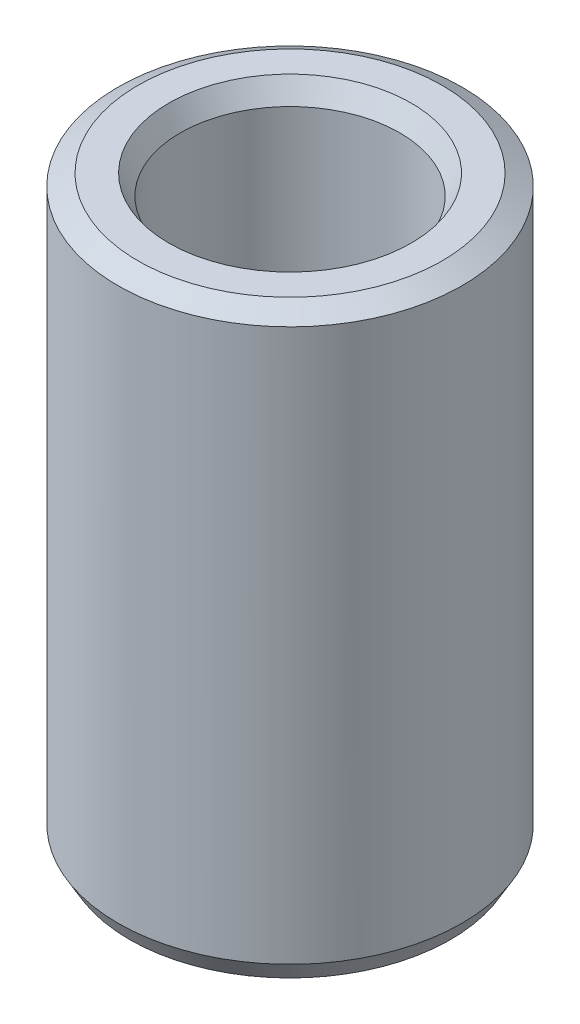
ISO-10303-21;
HEADER;
FILE_DESCRIPTION(('STEP AP214'),'2;1');
FILE_NAME('part.step','',(''),(''),'','','');
FILE_SCHEMA(('AUTOMOTIVE_DESIGN { 1 0 10303 214 1 1 1 1 }'));
ENDSEC;
DATA;
#1=APPLICATION_CONTEXT('core data for automotive mechanical design processes');
#2=APPLICATION_PROTOCOL_DEFINITION('international standard','automotive_design',2000,#1);
#3=PRODUCT_CONTEXT('',#1,'mechanical');
#4=PRODUCT('Part','Part','',(#3));
#5=PRODUCT_RELATED_PRODUCT_CATEGORY('part','',(#4));
#6=PRODUCT_DEFINITION_FORMATION('','',#4);
#7=PRODUCT_DEFINITION_CONTEXT('part definition',#1,'design');
#8=PRODUCT_DEFINITION('design','',#6,#7);
#9=PRODUCT_DEFINITION_SHAPE('','',#8);
#10=(LENGTH_UNIT() NAMED_UNIT(*) SI_UNIT(.MILLI.,.METRE.));
#11=(NAMED_UNIT(*) PLANE_ANGLE_UNIT() SI_UNIT($,.RADIAN.));
#12=(NAMED_UNIT(*) SI_UNIT($,.STERADIAN.) SOLID_ANGLE_UNIT());
#13=UNCERTAINTY_MEASURE_WITH_UNIT(LENGTH_MEASURE(1.E-05),#10,'distance_accuracy_value','');
#14=(GEOMETRIC_REPRESENTATION_CONTEXT(3) GLOBAL_UNCERTAINTY_ASSIGNED_CONTEXT((#13)) GLOBAL_UNIT_ASSIGNED_CONTEXT((#10,
#11,#12)) REPRESENTATION_CONTEXT('',''));
#15=CARTESIAN_POINT('',(0.,0.,0.));
#16=DIRECTION('',(0.,0.,1.));
#17=DIRECTION('',(1.,0.,0.));
#18=AXIS2_PLACEMENT_3D('',#15,#16,#17);
#19=CARTESIAN_POINT('',(0.,84.8043826320873,0.));
#20=DIRECTION('',(0.,-1.,0.));
#21=DIRECTION('',(0.,0.,-1.));
#22=AXIS2_PLACEMENT_3D('',#19,#20,#21);
#23=CYLINDRICAL_SURFACE('',#22,25.);
#24=CARTESIAN_POINT('',(0.,2.90175793023514,0.));
#25=DIRECTION('',(0.,1.,0.));
#26=DIRECTION('',(0.,0.,1.));
#27=AXIS2_PLACEMENT_3D('',#24,#25,#26);
#28=CIRCLE('',#27,25.);
#29=CARTESIAN_POINT('',(0.,2.90175793023514,25.));
#30=VERTEX_POINT('',#29);
#31=EDGE_CURVE('E10',#30,#30,#28,.T.);
#32=ORIENTED_EDGE('',*,*,#31,.T.);
#33=EDGE_LOOP('',(#32));
#34=FACE_BOUND('',#33,.T.);
#35=CARTESIAN_POINT('',(0.,83.1290519099429,0.));
#36=DIRECTION('',(0.,1.,0.));
#37=DIRECTION('',(0.,0.,1.));
#38=AXIS2_PLACEMENT_3D('',#35,#36,#37);
#39=CIRCLE('',#38,25.);
#40=CARTESIAN_POINT('',(0.,83.1290519099429,-25.));
#41=VERTEX_POINT('',#40);
#42=EDGE_CURVE('E50',#41,#41,#39,.F.);
#43=ORIENTED_EDGE('',*,*,#42,.T.);
#44=EDGE_LOOP('',(#43));
#45=FACE_BOUND('',#44,.T.);
#46=ADVANCED_FACE('F39',(#34,#45),#23,.T.);
#47=CARTESIAN_POINT('',(0.,84.8043826320873,0.));
#48=DIRECTION('',(0.,1.,0.));
#49=DIRECTION('',(0.,0.,1.));
#50=AXIS2_PLACEMENT_3D('',#47,#48,#49);
#51=PLANE('',#50);
#52=CARTESIAN_POINT('',(0.,84.8043826320873,0.));
#53=DIRECTION('',(0.,1.,0.));
#54=DIRECTION('',(0.,0.,1.));
#55=AXIS2_PLACEMENT_3D('',#52,#53,#54);
#56=CIRCLE('',#55,17.6229533207072);
#57=CARTESIAN_POINT('',(0.,84.8043826320873,17.6229533207072));
#58=VERTEX_POINT('',#57);
#59=EDGE_CURVE('E58',#58,#58,#56,.F.);
#60=ORIENTED_EDGE('',*,*,#59,.T.);
#61=EDGE_LOOP('',(#60));
#62=FACE_BOUND('',#61,.T.);
#63=CARTESIAN_POINT('',(0.,84.8043826320873,0.));
#64=DIRECTION('',(0.,1.,0.));
#65=DIRECTION('',(0.,0.,1.));
#66=AXIS2_PLACEMENT_3D('',#63,#64,#65);
#67=CIRCLE('',#66,22.0982420697649);
#68=CARTESIAN_POINT('',(0.,84.8043826320873,-22.0982420697649));
#69=VERTEX_POINT('',#68);
#70=EDGE_CURVE('E61',#69,#69,#67,.T.);
#71=ORIENTED_EDGE('',*,*,#70,.T.);
#72=EDGE_LOOP('',(#71));
#73=FACE_BOUND('',#72,.T.);
#74=ADVANCED_FACE('F88',(#62,#73),#51,.T.);
#75=CARTESIAN_POINT('',(0.,0.,0.));
#76=DIRECTION('',(0.,1.,0.));
#77=DIRECTION('',(0.,0.,1.));
#78=AXIS2_PLACEMENT_3D('',#75,#76,#77);
#79=PLANE('',#78);
#80=CARTESIAN_POINT('',(0.,0.,0.));
#81=DIRECTION('',(0.,1.,0.));
#82=DIRECTION('',(0.,0.,1.));
#83=AXIS2_PLACEMENT_3D('',#80,#81,#82);
#84=CIRCLE('',#83,18.8493805287979);
#85=CARTESIAN_POINT('',(0.,0.,-18.8493805287979));
#86=VERTEX_POINT('',#85);
#87=EDGE_CURVE('E51',#86,#86,#84,.T.);
#88=ORIENTED_EDGE('',*,*,#87,.T.);
#89=EDGE_LOOP('',(#88));
#90=FACE_BOUND('',#89,.T.);
#91=CARTESIAN_POINT('',(0.,0.,0.));
#92=DIRECTION('',(0.,1.,0.));
#93=DIRECTION('',(0.,0.,1.));
#94=AXIS2_PLACEMENT_3D('',#91,#92,#93);
#95=CIRCLE('',#94,23.3246692778556);
#96=CARTESIAN_POINT('',(0.,0.,23.3246692778556));
#97=VERTEX_POINT('',#96);
#98=EDGE_CURVE('E54',#97,#97,#95,.F.);
#99=ORIENTED_EDGE('',*,*,#98,.T.);
#100=EDGE_LOOP('',(#99));
#101=FACE_BOUND('',#100,.T.);
#102=ADVANCED_FACE('F83',(#90,#101),#79,.F.);
#103=CARTESIAN_POINT('',(0.,84.8043826320873,0.));
#104=DIRECTION('',(0.,-1.,0.));
#105=DIRECTION('',(0.,0.,-1.));
#106=AXIS2_PLACEMENT_3D('',#103,#104,#105);
#107=CYLINDRICAL_SURFACE('',#106,15.9476225985628);
#108=CARTESIAN_POINT('',(0.,81.9026247018521,0.));
#109=DIRECTION('',(0.,1.,0.));
#110=DIRECTION('',(0.,0.,1.));
#111=AXIS2_PLACEMENT_3D('',#108,#109,#110);
#112=CIRCLE('',#111,15.9476225985628);
#113=CARTESIAN_POINT('',(0.,81.9026247018521,15.9476225985628));
#114=VERTEX_POINT('',#113);
#115=EDGE_CURVE('E67',#114,#114,#112,.T.);
#116=ORIENTED_EDGE('',*,*,#115,.T.);
#117=EDGE_LOOP('',(#116));
#118=FACE_BOUND('',#117,.T.);
#119=CARTESIAN_POINT('',(0.,1.67533072214439,0.));
#120=DIRECTION('',(0.,1.,0.));
#121=DIRECTION('',(0.,0.,1.));
#122=AXIS2_PLACEMENT_3D('',#119,#120,#121);
#123=CIRCLE('',#122,15.9476225985628);
#124=CARTESIAN_POINT('',(0.,1.67533072214439,-15.9476225985628));
#125=VERTEX_POINT('',#124);
#126=EDGE_CURVE('E69',#125,#125,#123,.F.);
#127=ORIENTED_EDGE('',*,*,#126,.T.);
#128=EDGE_LOOP('',(#127));
#129=FACE_BOUND('',#128,.T.);
#130=ADVANCED_FACE('F71',(#118,#129),#107,.F.);
#131=CARTESIAN_POINT('',(0.,81.9026247018521,0.));
#132=DIRECTION('',(0.,1.,0.));
#133=DIRECTION('',(0.,0.,1.));
#134=AXIS2_PLACEMENT_3D('',#131,#132,#133);
#135=CONICAL_SURFACE('',#134,15.9476225985628,0.523598775598298);
#136=ORIENTED_EDGE('',*,*,#59,.F.);
#137=EDGE_LOOP('',(#136));
#138=FACE_BOUND('',#137,.T.);
#139=ORIENTED_EDGE('',*,*,#115,.F.);
#140=EDGE_LOOP('',(#139));
#141=FACE_BOUND('',#140,.T.);
#142=ADVANCED_FACE('F77',(#138,#141),#135,.F.);
#143=CARTESIAN_POINT('',(0.,0.,0.));
#144=DIRECTION('',(0.,-1.,0.));
#145=DIRECTION('',(0.,0.,-1.));
#146=AXIS2_PLACEMENT_3D('',#143,#144,#145);
#147=CONICAL_SURFACE('',#146,18.8493805287979,1.0471975511966);
#148=CARTESIAN_POINT('',(0.,1.67533072214439,-15.9476225985628));
#149=CARTESIAN_POINT('',(0.,1.65787936045539,-15.9778492436694));
#150=CARTESIAN_POINT('',(0.,1.64042799876638,-16.008075888776));
#151=CARTESIAN_POINT('',(0.,1.60552527538837,-16.0685291789893));
#152=CARTESIAN_POINT('',(0.,1.58807391369937,-16.0987558240959));
#153=CARTESIAN_POINT('',(0.,1.55317119032136,-16.1592091143091));
#154=CARTESIAN_POINT('',(0.,1.53571982863236,-16.1894357594157));
#155=CARTESIAN_POINT('',(0.,1.50081710525435,-16.249889049629));
#156=CARTESIAN_POINT('',(0.,1.48336574356534,-16.2801156947356));
#157=CARTESIAN_POINT('',(0.,1.44846302018734,-16.3405689849488));
#158=CARTESIAN_POINT('',(0.,1.43101165849833,-16.3707956300554));
#159=CARTESIAN_POINT('',(0.,1.39610893512032,-16.4312489202687));
#160=CARTESIAN_POINT('',(0.,1.37865757343132,-16.4614755653753));
#161=CARTESIAN_POINT('',(0.,1.34375485005331,-16.5219288555885));
#162=CARTESIAN_POINT('',(0.,1.32630348836431,-16.5521555006951));
#163=CARTESIAN_POINT('',(0.,1.2914007649863,-16.6126087909084));
#164=CARTESIAN_POINT('',(0.,1.2739494032973,-16.642835436015));
#165=CARTESIAN_POINT('',(0.,1.23904667991929,-16.7032887262282));
#166=CARTESIAN_POINT('',(0.,1.22159531823028,-16.7335153713348));
#167=CARTESIAN_POINT('',(0.,1.18669259485227,-16.7939686615481));
#168=CARTESIAN_POINT('',(0.,1.16924123316327,-16.8241953066547));
#169=CARTESIAN_POINT('',(0.,1.13433850978526,-16.8846485968679));
#170=CARTESIAN_POINT('',(0.,1.11688714809626,-16.9148752419745));
#171=CARTESIAN_POINT('',(0.,1.08198442471825,-16.9753285321877));
#172=CARTESIAN_POINT('',(0.,1.06453306302925,-17.0055551772944));
#173=CARTESIAN_POINT('',(0.,1.02963033965124,-17.0660084675076));
#174=CARTESIAN_POINT('',(0.,1.01217897796223,-17.0962351126142));
#175=CARTESIAN_POINT('',(0.,0.977276254584226,-17.1566884028274));
#176=CARTESIAN_POINT('',(0.,0.959824892895223,-17.1869150479341));
#177=CARTESIAN_POINT('',(0.,0.924922169517215,-17.2473683381473));
#178=CARTESIAN_POINT('',(0.,0.90747080782821,-17.2775949832539));
#179=CARTESIAN_POINT('',(0.,0.872568084450202,-17.3380482734671));
#180=CARTESIAN_POINT('',(0.,0.855116722761198,-17.3682749185738));
#181=CARTESIAN_POINT('',(0.,0.82021399938319,-17.428728208787));
#182=CARTESIAN_POINT('',(0.,0.802762637694186,-17.4589548538936));
#183=CARTESIAN_POINT('',(0.,0.767859914316178,-17.5194081441068));
#184=CARTESIAN_POINT('',(0.,0.750408552627174,-17.5496347892135));
#185=CARTESIAN_POINT('',(0.,0.715505829249166,-17.6100880794267));
#186=CARTESIAN_POINT('',(0.,0.698054467560162,-17.6403147245333));
#187=CARTESIAN_POINT('',(0.,0.663151744182154,-17.7007680147465));
#188=CARTESIAN_POINT('',(0.,0.645700382493149,-17.7309946598531));
#189=CARTESIAN_POINT('',(0.,0.610797659115141,-17.7914479500664));
#190=CARTESIAN_POINT('',(0.,0.593346297426138,-17.821674595173));
#191=CARTESIAN_POINT('',(0.,0.55844357404813,-17.8821278853862));
#192=CARTESIAN_POINT('',(0.,0.540992212359125,-17.9123545304928));
#193=CARTESIAN_POINT('',(0.,0.506089488981117,-17.9728078207061));
#194=CARTESIAN_POINT('',(0.,0.488638127292113,-18.0030344658127));
#195=CARTESIAN_POINT('',(0.,0.453735403914105,-18.0634877560259));
#196=CARTESIAN_POINT('',(0.,0.436284042225102,-18.0937144011325));
#197=CARTESIAN_POINT('',(0.,0.401381318847093,-18.1541676913458));
#198=CARTESIAN_POINT('',(0.,0.383929957158089,-18.1843943364524));
#199=CARTESIAN_POINT('',(0.,0.349027233780081,-18.2448476266656));
#200=CARTESIAN_POINT('',(0.,0.331575872091077,-18.2750742717722));
#201=CARTESIAN_POINT('',(0.,0.296673148713069,-18.3355275619855));
#202=CARTESIAN_POINT('',(0.,0.279221787024064,-18.3657542070921));
#203=CARTESIAN_POINT('',(0.,0.244319063646056,-18.4262074973053));
#204=CARTESIAN_POINT('',(0.,0.226867701957053,-18.4564341424119));
#205=CARTESIAN_POINT('',(0.,0.191964978579045,-18.5168874326252));
#206=CARTESIAN_POINT('',(0.,0.17451361689004,-18.5471140777318));
#207=CARTESIAN_POINT('',(0.,0.139610893512032,-18.607567367945));
#208=CARTESIAN_POINT('',(0.,0.122159531823028,-18.6377940130516));
#209=CARTESIAN_POINT('',(0.,0.0872568084450206,-18.6982473032649));
#210=CARTESIAN_POINT('',(0.,0.0698054467560162,-18.7284739483715));
#211=CARTESIAN_POINT('',(0.,0.0349027233780076,-18.7889272385847));
#212=CARTESIAN_POINT('',(0.,0.0174513616890032,-18.8191538836913));
#213=CARTESIAN_POINT('',(0.,0.,-18.8493805287979));
#214=B_SPLINE_CURVE_WITH_KNOTS('',3,(#148,#149,#150,#151,#152,#153,#154,#155,#156,#157,#158,
#159,#160,#161,#162,#163,#164,#165,#166,#167,#168,#169,#170,#171,#172,#173,#174,#175,#176,#177,
#178,#179,#180,#181,#182,#183,#184,#185,#186,#187,#188,#189,#190,#191,#192,#193,#194,#195,#196,
#197,#198,#199,#200,#201,#202,#203,#204,#205,#206,#207,#208,#209,#210,#211,#212,#213),
.UNSPECIFIED.,.F.,.F.,(4,2,2,2,2,2,2,2,2,2,2,2,2,2,2,2,2,2,2,2,2,2,2,2,2,2,2,2,2,2,2,2,4),(0.,
0.104708170134025,0.209416340268047,0.314124510402073,0.418832680536095,0.52354085067012,
0.628249020804145,0.732957190938167,0.837665361072192,0.942373531206214,1.04708170134024,
1.15178987147426,1.25649804160829,1.36120621174231,1.46591438187633,1.57062255201036,
1.67533072214438,1.78003889227841,1.88474706241243,1.98945523254645,2.09416340268048,
2.1988715728145,2.30357974294852,2.40828791308255,2.51299608321657,2.6177042533506,
2.72241242348462,2.82712059361864,2.93182876375267,3.03653693388669,3.14124510402072,
3.24595327415474,3.35066144428876),.UNSPECIFIED.);
#215=EDGE_CURVE('BSEAM73',#125,#86,#214,.T.);
#216=ORIENTED_EDGE('',*,*,#126,.F.);
#217=ORIENTED_EDGE('',*,*,#87,.F.);
#218=ORIENTED_EDGE('',*,*,#215,.T.);
#219=ORIENTED_EDGE('',*,*,#215,.F.);
#220=EDGE_LOOP('',(#216,#218,#217,#219));
#221=FACE_BOUND('',#220,.T.);
#222=ADVANCED_FACE('F73',(#221),#147,.F.);
#223=CARTESIAN_POINT('',(0.,2.90175793023514,0.));
#224=DIRECTION('',(0.,1.,0.));
#225=DIRECTION('',(0.,0.,1.));
#226=AXIS2_PLACEMENT_3D('',#223,#224,#225);
#227=CONICAL_SURFACE('',#226,25.,0.523598775598303);
#228=ORIENTED_EDGE('',*,*,#98,.F.);
#229=EDGE_LOOP('',(#228));
#230=FACE_BOUND('',#229,.T.);
#231=ORIENTED_EDGE('',*,*,#31,.F.);
#232=EDGE_LOOP('',(#231));
#233=FACE_BOUND('',#232,.T.);
#234=ADVANCED_FACE('F76',(#230,#233),#227,.T.);
#235=CARTESIAN_POINT('',(0.,84.8043826320873,0.));
#236=DIRECTION('',(0.,-1.,0.));
#237=DIRECTION('',(0.,0.,-1.));
#238=AXIS2_PLACEMENT_3D('',#235,#236,#237);
#239=CONICAL_SURFACE('',#238,22.0982420697649,1.04719755119659);
#240=CARTESIAN_POINT('',(0.,83.1290519099429,-25.));
#241=CARTESIAN_POINT('',(0.,83.1465032716319,-24.9697733548934));
#242=CARTESIAN_POINT('',(0.,83.1639546333209,-24.9395467097868));
#243=CARTESIAN_POINT('',(0.,83.1988573566989,-24.8790934195736));
#244=CARTESIAN_POINT('',(0.,83.2163087183879,-24.8488667744669));
#245=CARTESIAN_POINT('',(0.,83.2512114417659,-24.7884134842537));
#246=CARTESIAN_POINT('',(0.,83.2686628034549,-24.7581868391471));
#247=CARTESIAN_POINT('',(0.,83.3035655268329,-24.6977335489339));
#248=CARTESIAN_POINT('',(0.,83.3210168885219,-24.6675069038272));
#249=CARTESIAN_POINT('',(0.,83.3559196118999,-24.607053613614));
#250=CARTESIAN_POINT('',(0.,83.3733709735889,-24.5768269685074));
#251=CARTESIAN_POINT('',(0.,83.4082736969669,-24.5163736782942));
#252=CARTESIAN_POINT('',(0.,83.4257250586559,-24.4861470331875));
#253=CARTESIAN_POINT('',(0.,83.460627782034,-24.4256937429743));
#254=CARTESIAN_POINT('',(0.,83.478079143723,-24.3954670978677));
#255=CARTESIAN_POINT('',(0.,83.512981867101,-24.3350138076545));
#256=CARTESIAN_POINT('',(0.,83.53043322879,-24.3047871625479));
#257=CARTESIAN_POINT('',(0.,83.565335952168,-24.2443338723346));
#258=CARTESIAN_POINT('',(0.,83.582787313857,-24.214107227228));
#259=CARTESIAN_POINT('',(0.,83.617690037235,-24.1536539370148));
#260=CARTESIAN_POINT('',(0.,83.635141398924,-24.1234272919082));
#261=CARTESIAN_POINT('',(0.,83.670044122302,-24.0629740016949));
#262=CARTESIAN_POINT('',(0.,83.687495483991,-24.0327473565883));
#263=CARTESIAN_POINT('',(0.,83.722398207369,-23.9722940663751));
#264=CARTESIAN_POINT('',(0.,83.739849569058,-23.9420674212685));
#265=CARTESIAN_POINT('',(0.,83.774752292436,-23.8816141310552));
#266=CARTESIAN_POINT('',(0.,83.792203654125,-23.8513874859486));
#267=CARTESIAN_POINT('',(0.,83.827106377503,-23.7909341957354));
#268=CARTESIAN_POINT('',(0.,83.844557739192,-23.7607075506288));
#269=CARTESIAN_POINT('',(0.,83.87946046257,-23.7002542604155));
#270=CARTESIAN_POINT('',(0.,83.896911824259,-23.6700276153089));
#271=CARTESIAN_POINT('',(0.,83.9318145476371,-23.6095743250957));
#272=CARTESIAN_POINT('',(0.,83.9492659093261,-23.5793476799891));
#273=CARTESIAN_POINT('',(0.,83.9841686327041,-23.5188943897759));
#274=CARTESIAN_POINT('',(0.,84.0016199943931,-23.4886677446692));
#275=CARTESIAN_POINT('',(0.,84.0365227177711,-23.428214454456));
#276=CARTESIAN_POINT('',(0.,84.0539740794601,-23.3979878093494));
#277=CARTESIAN_POINT('',(0.,84.0888768028381,-23.3375345191362));
#278=CARTESIAN_POINT('',(0.,84.1063281645271,-23.3073078740295));
#279=CARTESIAN_POINT('',(0.,84.1412308879051,-23.2468545838163));
#280=CARTESIAN_POINT('',(0.,84.1586822495941,-23.2166279387097));
#281=CARTESIAN_POINT('',(0.,84.1935849729721,-23.1561746484965));
#282=CARTESIAN_POINT('',(0.,84.2110363346611,-23.1259480033898));
#283=CARTESIAN_POINT('',(0.,84.2459390580391,-23.0654947131766));
#284=CARTESIAN_POINT('',(0.,84.2633904197281,-23.03526806807));
#285=CARTESIAN_POINT('',(0.,84.2982931431061,-22.9748147778568));
#286=CARTESIAN_POINT('',(0.,84.3157445047951,-22.9445881327502));
#287=CARTESIAN_POINT('',(0.,84.3506472281731,-22.8841348425369));
#288=CARTESIAN_POINT('',(0.,84.3680985898622,-22.8539081974303));
#289=CARTESIAN_POINT('',(0.,84.4030013132402,-22.7934549072171));
#290=CARTESIAN_POINT('',(0.,84.4204526749292,-22.7632282621105));
#291=CARTESIAN_POINT('',(0.,84.4553553983072,-22.7027749718972));
#292=CARTESIAN_POINT('',(0.,84.4728067599962,-22.6725483267906));
#293=CARTESIAN_POINT('',(0.,84.5077094833742,-22.6120950365774));
#294=CARTESIAN_POINT('',(0.,84.5251608450632,-22.5818683914708));
#295=CARTESIAN_POINT('',(0.,84.5600635684412,-22.5214151012575));
#296=CARTESIAN_POINT('',(0.,84.5775149301302,-22.4911884561509));
#297=CARTESIAN_POINT('',(0.,84.6124176535082,-22.4307351659377));
#298=CARTESIAN_POINT('',(0.,84.6298690151972,-22.4005085208311));
#299=CARTESIAN_POINT('',(0.,84.6647717385752,-22.3400552306178));
#300=CARTESIAN_POINT('',(0.,84.6822231002642,-22.3098285855112));
#301=CARTESIAN_POINT('',(0.,84.7171258236422,-22.249375295298));
#302=CARTESIAN_POINT('',(0.,84.7345771853313,-22.2191486501914));
#303=CARTESIAN_POINT('',(0.,84.7694799087093,-22.1586953599782));
#304=CARTESIAN_POINT('',(0.,84.7869312703983,-22.1284687148715));
#305=CARTESIAN_POINT('',(0.,84.8043826320873,-22.0982420697649));
#306=B_SPLINE_CURVE_WITH_KNOTS('',3,(#240,#241,#242,#243,#244,#245,#246,#247,#248,#249,#250,
#251,#252,#253,#254,#255,#256,#257,#258,#259,#260,#261,#262,#263,#264,#265,#266,#267,#268,#269,
#270,#271,#272,#273,#274,#275,#276,#277,#278,#279,#280,#281,#282,#283,#284,#285,#286,#287,#288,
#289,#290,#291,#292,#293,#294,#295,#296,#297,#298,#299,#300,#301,#302,#303,#304,#305),
.UNSPECIFIED.,.F.,.F.,(4,2,2,2,2,2,2,2,2,2,2,2,2,2,2,2,2,2,2,2,2,2,2,2,2,2,2,2,2,2,2,2,4),(0.,
0.104708170134026,0.209416340268049,0.314124510402071,0.418832680536097,0.52354085067012,
0.628249020804143,0.732957190938166,0.837665361072191,0.942373531206214,1.04708170134024,
1.15178987147426,1.25649804160828,1.3612062117423,1.46591438187633,1.57062255201035,
1.67533072214437,1.7800388922784,1.88474706241242,1.98945523254644,2.09416340268047,
2.19887157281449,2.30357974294851,2.40828791308254,2.51299608321656,2.61770425335058,
2.72241242348461,2.82712059361863,2.93182876375265,3.03653693388668,3.1412451040207,
3.24595327415473,3.35066144428875),.UNSPECIFIED.);
#307=EDGE_CURVE('BSEAM45',#41,#69,#306,.T.);
#308=ORIENTED_EDGE('',*,*,#42,.F.);
#309=ORIENTED_EDGE('',*,*,#70,.F.);
#310=ORIENTED_EDGE('',*,*,#307,.T.);
#311=ORIENTED_EDGE('',*,*,#307,.F.);
#312=EDGE_LOOP('',(#308,#310,#309,#311));
#313=FACE_BOUND('',#312,.T.);
#314=ADVANCED_FACE('F45',(#313),#239,.T.);
#315=CLOSED_SHELL('',(#46,#74,#102,#130,#142,#222,#234,#314));
#316=MANIFOLD_SOLID_BREP('B2',#315);
#317=ADVANCED_BREP_SHAPE_REPRESENTATION('',(#18,#316),#14);
#318=SHAPE_DEFINITION_REPRESENTATION(#9,#317);
ENDSEC;
END-ISO-10303-21;
